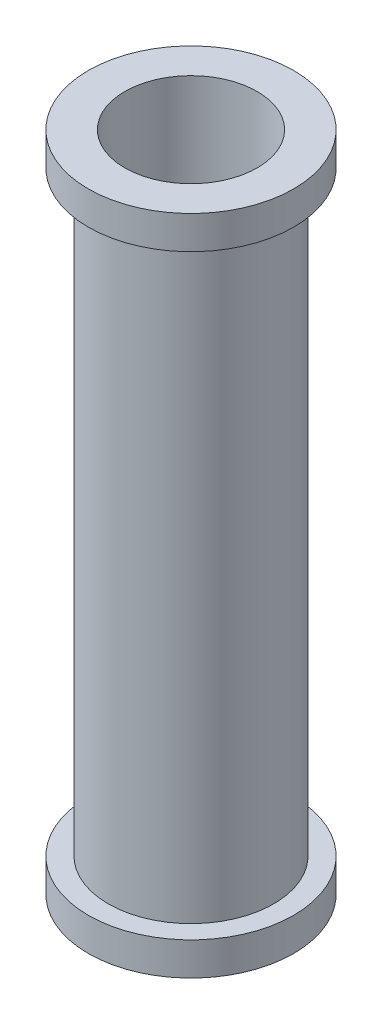
ISO-10303-21;
HEADER;
FILE_DESCRIPTION(('STEP AP214'),'2;1');
FILE_NAME('part.step','',(''),(''),'','','');
FILE_SCHEMA(('AUTOMOTIVE_DESIGN { 1 0 10303 214 1 1 1 1 }'));
ENDSEC;
DATA;
#1=APPLICATION_CONTEXT('core data for automotive mechanical design processes');
#2=APPLICATION_PROTOCOL_DEFINITION('international standard','automotive_design',2000,#1);
#3=PRODUCT_CONTEXT('',#1,'mechanical');
#4=PRODUCT('Part','Part','',(#3));
#5=PRODUCT_RELATED_PRODUCT_CATEGORY('part','',(#4));
#6=PRODUCT_DEFINITION_FORMATION('','',#4);
#7=PRODUCT_DEFINITION_CONTEXT('part definition',#1,'design');
#8=PRODUCT_DEFINITION('design','',#6,#7);
#9=PRODUCT_DEFINITION_SHAPE('','',#8);
#10=(LENGTH_UNIT() NAMED_UNIT(*) SI_UNIT(.MILLI.,.METRE.));
#11=(NAMED_UNIT(*) PLANE_ANGLE_UNIT() SI_UNIT($,.RADIAN.));
#12=(NAMED_UNIT(*) SI_UNIT($,.STERADIAN.) SOLID_ANGLE_UNIT());
#13=UNCERTAINTY_MEASURE_WITH_UNIT(LENGTH_MEASURE(1.E-05),#10,'distance_accuracy_value','');
#14=(GEOMETRIC_REPRESENTATION_CONTEXT(3) GLOBAL_UNCERTAINTY_ASSIGNED_CONTEXT((#13)) GLOBAL_UNIT_ASSIGNED_CONTEXT((#10,
#11,#12)) REPRESENTATION_CONTEXT('',''));
#15=CARTESIAN_POINT('',(0.,0.,0.));
#16=DIRECTION('',(0.,0.,1.));
#17=DIRECTION('',(1.,0.,0.));
#18=AXIS2_PLACEMENT_3D('',#15,#16,#17);
#19=CARTESIAN_POINT('',(0.,1.,0.));
#20=DIRECTION('',(0.,-1.,0.));
#21=DIRECTION('',(0.,0.,-1.));
#22=AXIS2_PLACEMENT_3D('',#19,#20,#21);
#23=CYLINDRICAL_SURFACE('',#22,0.25);
#24=CARTESIAN_POINT('',(0.,0.1,0.));
#25=DIRECTION('',(0.,1.,0.));
#26=DIRECTION('',(0.,0.,1.));
#27=AXIS2_PLACEMENT_3D('',#24,#25,#26);
#28=CIRCLE('',#27,0.25);
#29=CARTESIAN_POINT('',(0.,0.1,0.25));
#30=VERTEX_POINT('',#29);
#31=EDGE_CURVE('E34',#30,#30,#28,.T.);
#32=ORIENTED_EDGE('',*,*,#31,.T.);
#33=EDGE_LOOP('',(#32));
#34=FACE_BOUND('',#33,.T.);
#35=CARTESIAN_POINT('',(0.,1.9,0.));
#36=DIRECTION('',(0.,1.,0.));
#37=DIRECTION('',(0.,0.,1.));
#38=AXIS2_PLACEMENT_3D('',#35,#36,#37);
#39=CIRCLE('',#38,0.25);
#40=CARTESIAN_POINT('',(0.,1.9,0.25));
#41=VERTEX_POINT('',#40);
#42=EDGE_CURVE('E49',#41,#41,#39,.T.);
#43=ORIENTED_EDGE('',*,*,#42,.F.);
#44=EDGE_LOOP('',(#43));
#45=FACE_BOUND('',#44,.T.);
#46=ADVANCED_FACE('F31',(#34,#45),#23,.T.);
#47=CARTESIAN_POINT('',(0.,0.,0.));
#48=DIRECTION('',(0.,1.,0.));
#49=DIRECTION('',(0.,0.,1.));
#50=AXIS2_PLACEMENT_3D('',#47,#48,#49);
#51=PLANE('',#50);
#52=CARTESIAN_POINT('',(0.,0.,0.));
#53=DIRECTION('',(0.,1.,0.));
#54=DIRECTION('',(0.,0.,1.));
#55=AXIS2_PLACEMENT_3D('',#52,#53,#54);
#56=CIRCLE('',#55,0.2);
#57=CARTESIAN_POINT('',(0.,0.,0.2));
#58=VERTEX_POINT('',#57);
#59=EDGE_CURVE('E10',#58,#58,#56,.T.);
#60=ORIENTED_EDGE('',*,*,#59,.T.);
#61=EDGE_LOOP('',(#60));
#62=FACE_BOUND('',#61,.T.);
#63=CARTESIAN_POINT('',(0.,0.,0.));
#64=DIRECTION('',(0.,1.,0.));
#65=DIRECTION('',(0.,0.,1.));
#66=AXIS2_PLACEMENT_3D('',#63,#64,#65);
#67=CIRCLE('',#66,0.31);
#68=CARTESIAN_POINT('',(0.,0.,0.31));
#69=VERTEX_POINT('',#68);
#70=EDGE_CURVE('E43',#69,#69,#67,.T.);
#71=ORIENTED_EDGE('',*,*,#70,.F.);
#72=EDGE_LOOP('',(#71));
#73=FACE_BOUND('',#72,.T.);
#74=ADVANCED_FACE('F74',(#62,#73),#51,.F.);
#75=CARTESIAN_POINT('',(0.,1.,0.));
#76=DIRECTION('',(0.,-1.,0.));
#77=DIRECTION('',(0.,0.,-1.));
#78=AXIS2_PLACEMENT_3D('',#75,#76,#77);
#79=CYLINDRICAL_SURFACE('',#78,0.2);
#80=ORIENTED_EDGE('',*,*,#59,.F.);
#81=EDGE_LOOP('',(#80));
#82=FACE_BOUND('',#81,.T.);
#83=CARTESIAN_POINT('',(0.,2.,0.));
#84=DIRECTION('',(0.,1.,0.));
#85=DIRECTION('',(0.,0.,1.));
#86=AXIS2_PLACEMENT_3D('',#83,#84,#85);
#87=CIRCLE('',#86,0.2);
#88=CARTESIAN_POINT('',(0.,2.,0.2));
#89=VERTEX_POINT('',#88);
#90=EDGE_CURVE('E46',#89,#89,#87,.T.);
#91=ORIENTED_EDGE('',*,*,#90,.T.);
#92=EDGE_LOOP('',(#91));
#93=FACE_BOUND('',#92,.T.);
#94=ADVANCED_FACE('F79',(#82,#93),#79,.F.);
#95=CARTESIAN_POINT('',(0.,0.1,0.));
#96=DIRECTION('',(0.,-1.,0.));
#97=DIRECTION('',(0.,0.,-1.));
#98=AXIS2_PLACEMENT_3D('',#95,#96,#97);
#99=CYLINDRICAL_SURFACE('',#98,0.31);
#100=CARTESIAN_POINT('',(0.,0.1,0.));
#101=DIRECTION('',(0.,1.,0.));
#102=DIRECTION('',(0.,0.,1.));
#103=AXIS2_PLACEMENT_3D('',#100,#101,#102);
#104=CIRCLE('',#103,0.31);
#105=CARTESIAN_POINT('',(0.,0.1,0.31));
#106=VERTEX_POINT('',#105);
#107=EDGE_CURVE('E41',#106,#106,#104,.T.);
#108=ORIENTED_EDGE('',*,*,#107,.F.);
#109=EDGE_LOOP('',(#108));
#110=FACE_BOUND('',#109,.T.);
#111=ORIENTED_EDGE('',*,*,#70,.T.);
#112=EDGE_LOOP('',(#111));
#113=FACE_BOUND('',#112,.T.);
#114=ADVANCED_FACE('F87',(#110,#113),#99,.T.);
#115=CARTESIAN_POINT('',(0.,0.1,0.));
#116=DIRECTION('',(0.,1.,0.));
#117=DIRECTION('',(0.,0.,1.));
#118=AXIS2_PLACEMENT_3D('',#115,#116,#117);
#119=PLANE('',#118);
#120=ORIENTED_EDGE('',*,*,#31,.F.);
#121=EDGE_LOOP('',(#120));
#122=FACE_BOUND('',#121,.T.);
#123=ORIENTED_EDGE('',*,*,#107,.T.);
#124=EDGE_LOOP('',(#123));
#125=FACE_BOUND('',#124,.T.);
#126=ADVANCED_FACE('F84',(#122,#125),#119,.T.);
#127=CARTESIAN_POINT('',(0.,2.,0.));
#128=DIRECTION('',(0.,-1.,0.));
#129=DIRECTION('',(0.,0.,1.));
#130=AXIS2_PLACEMENT_3D('',#127,#128,#129);
#131=PLANE('',#130);
#132=ORIENTED_EDGE('',*,*,#90,.F.);
#133=EDGE_LOOP('',(#132));
#134=FACE_BOUND('',#133,.T.);
#135=CARTESIAN_POINT('',(0.,2.,0.));
#136=DIRECTION('',(0.,1.,0.));
#137=DIRECTION('',(0.,0.,1.));
#138=AXIS2_PLACEMENT_3D('',#135,#136,#137);
#139=CIRCLE('',#138,0.31);
#140=CARTESIAN_POINT('',(0.,2.,0.31));
#141=VERTEX_POINT('',#140);
#142=EDGE_CURVE('E55',#141,#141,#139,.T.);
#143=ORIENTED_EDGE('',*,*,#142,.T.);
#144=EDGE_LOOP('',(#143));
#145=FACE_BOUND('',#144,.T.);
#146=ADVANCED_FACE('F71',(#134,#145),#131,.F.);
#147=CARTESIAN_POINT('',(0.,1.9,0.));
#148=DIRECTION('',(0.,1.,0.));
#149=DIRECTION('',(0.,0.,-1.));
#150=AXIS2_PLACEMENT_3D('',#147,#148,#149);
#151=CYLINDRICAL_SURFACE('',#150,0.31);
#152=CARTESIAN_POINT('',(0.,1.9,0.));
#153=DIRECTION('',(0.,1.,0.));
#154=DIRECTION('',(0.,0.,1.));
#155=AXIS2_PLACEMENT_3D('',#152,#153,#154);
#156=CIRCLE('',#155,0.31);
#157=CARTESIAN_POINT('',(0.,1.9,0.31));
#158=VERTEX_POINT('',#157);
#159=EDGE_CURVE('E52',#158,#158,#156,.T.);
#160=ORIENTED_EDGE('',*,*,#159,.T.);
#161=EDGE_LOOP('',(#160));
#162=FACE_BOUND('',#161,.T.);
#163=ORIENTED_EDGE('',*,*,#142,.F.);
#164=EDGE_LOOP('',(#163));
#165=FACE_BOUND('',#164,.T.);
#166=ADVANCED_FACE('F61',(#162,#165),#151,.T.);
#167=CARTESIAN_POINT('',(0.,1.9,0.));
#168=DIRECTION('',(0.,-1.,0.));
#169=DIRECTION('',(0.,0.,1.));
#170=AXIS2_PLACEMENT_3D('',#167,#168,#169);
#171=PLANE('',#170);
#172=ORIENTED_EDGE('',*,*,#42,.T.);
#173=EDGE_LOOP('',(#172));
#174=FACE_BOUND('',#173,.T.);
#175=ORIENTED_EDGE('',*,*,#159,.F.);
#176=EDGE_LOOP('',(#175));
#177=FACE_BOUND('',#176,.T.);
#178=ADVANCED_FACE('F64',(#174,#177),#171,.T.);
#179=CLOSED_SHELL('',(#46,#74,#94,#114,#126,#146,#166,#178));
#180=MANIFOLD_SOLID_BREP('B2',#179);
#181=ADVANCED_BREP_SHAPE_REPRESENTATION('',(#18,#180),#14);
#182=SHAPE_DEFINITION_REPRESENTATION(#9,#181);
ENDSEC;
END-ISO-10303-21;
